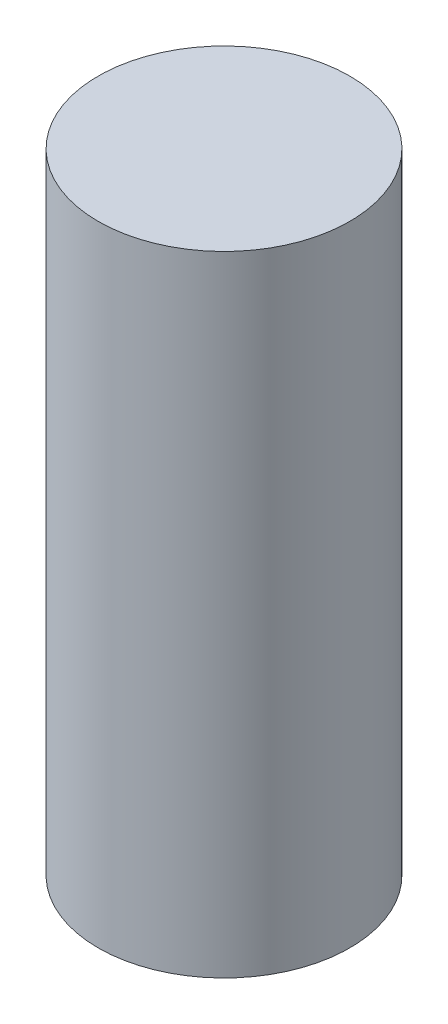
ISO-10303-21;
HEADER;
FILE_DESCRIPTION(('STEP AP214'),'2;1');
FILE_NAME('part.step','',(''),(''),'','','');
FILE_SCHEMA(('AUTOMOTIVE_DESIGN { 1 0 10303 214 1 1 1 1 }'));
ENDSEC;
DATA;
#1=APPLICATION_CONTEXT('core data for automotive mechanical design processes');
#2=APPLICATION_PROTOCOL_DEFINITION('international standard','automotive_design',2000,#1);
#3=PRODUCT_CONTEXT('',#1,'mechanical');
#4=PRODUCT('Part','Part','',(#3));
#5=PRODUCT_RELATED_PRODUCT_CATEGORY('part','',(#4));
#6=PRODUCT_DEFINITION_FORMATION('','',#4);
#7=PRODUCT_DEFINITION_CONTEXT('part definition',#1,'design');
#8=PRODUCT_DEFINITION('design','',#6,#7);
#9=PRODUCT_DEFINITION_SHAPE('','',#8);
#10=(LENGTH_UNIT() NAMED_UNIT(*) SI_UNIT(.MILLI.,.METRE.));
#11=(NAMED_UNIT(*) PLANE_ANGLE_UNIT() SI_UNIT($,.RADIAN.));
#12=(NAMED_UNIT(*) SI_UNIT($,.STERADIAN.) SOLID_ANGLE_UNIT());
#13=UNCERTAINTY_MEASURE_WITH_UNIT(LENGTH_MEASURE(1.E-05),#10,'distance_accuracy_value','');
#14=(GEOMETRIC_REPRESENTATION_CONTEXT(3) GLOBAL_UNCERTAINTY_ASSIGNED_CONTEXT((#13)) GLOBAL_UNIT_ASSIGNED_CONTEXT((#10,
#11,#12)) REPRESENTATION_CONTEXT('',''));
#15=CARTESIAN_POINT('',(0.,0.,0.));
#16=DIRECTION('',(0.,0.,1.));
#17=DIRECTION('',(1.,0.,0.));
#18=AXIS2_PLACEMENT_3D('',#15,#16,#17);
#19=CARTESIAN_POINT('',(0.,15.875,0.));
#20=DIRECTION('',(0.,-1.,0.));
#21=DIRECTION('',(0.,0.,-1.));
#22=AXIS2_PLACEMENT_3D('',#19,#20,#21);
#23=CYLINDRICAL_SURFACE('',#22,3.175);
#24=CARTESIAN_POINT('',(0.,15.875,0.));
#25=DIRECTION('',(0.,1.,0.));
#26=DIRECTION('',(0.,0.,1.));
#27=AXIS2_PLACEMENT_3D('',#24,#25,#26);
#28=CIRCLE('',#27,3.175);
#29=CARTESIAN_POINT('',(0.,15.875,3.175));
#30=VERTEX_POINT('',#29);
#31=EDGE_CURVE('E10',#30,#30,#28,.T.);
#32=ORIENTED_EDGE('',*,*,#31,.F.);
#33=EDGE_LOOP('',(#32));
#34=FACE_BOUND('',#33,.T.);
#35=CARTESIAN_POINT('',(0.,0.,0.));
#36=DIRECTION('',(0.,1.,0.));
#37=DIRECTION('',(0.,0.,1.));
#38=AXIS2_PLACEMENT_3D('',#35,#36,#37);
#39=CIRCLE('',#38,3.175);
#40=CARTESIAN_POINT('',(0.,0.,3.175));
#41=VERTEX_POINT('',#40);
#42=EDGE_CURVE('E40',#41,#41,#39,.T.);
#43=ORIENTED_EDGE('',*,*,#42,.T.);
#44=EDGE_LOOP('',(#43));
#45=FACE_BOUND('',#44,.T.);
#46=ADVANCED_FACE('F37',(#34,#45),#23,.T.);
#47=CARTESIAN_POINT('',(0.,15.875,0.));
#48=DIRECTION('',(0.,1.,0.));
#49=DIRECTION('',(0.,0.,1.));
#50=AXIS2_PLACEMENT_3D('',#47,#48,#49);
#51=PLANE('',#50);
#52=ORIENTED_EDGE('',*,*,#31,.T.);
#53=EDGE_LOOP('',(#52));
#54=FACE_BOUND('',#53,.T.);
#55=ADVANCED_FACE('F54',(#54),#51,.T.);
#56=CARTESIAN_POINT('',(0.,0.,0.));
#57=DIRECTION('',(0.,1.,0.));
#58=DIRECTION('',(0.,0.,1.));
#59=AXIS2_PLACEMENT_3D('',#56,#57,#58);
#60=PLANE('',#59);
#61=ORIENTED_EDGE('',*,*,#42,.F.);
#62=EDGE_LOOP('',(#61));
#63=FACE_BOUND('',#62,.T.);
#64=ADVANCED_FACE('F52',(#63),#60,.F.);
#65=CLOSED_SHELL('',(#46,#55,#64));
#66=MANIFOLD_SOLID_BREP('B2',#65);
#67=ADVANCED_BREP_SHAPE_REPRESENTATION('',(#18,#66),#14);
#68=SHAPE_DEFINITION_REPRESENTATION(#9,#67);
ENDSEC;
END-ISO-10303-21;
